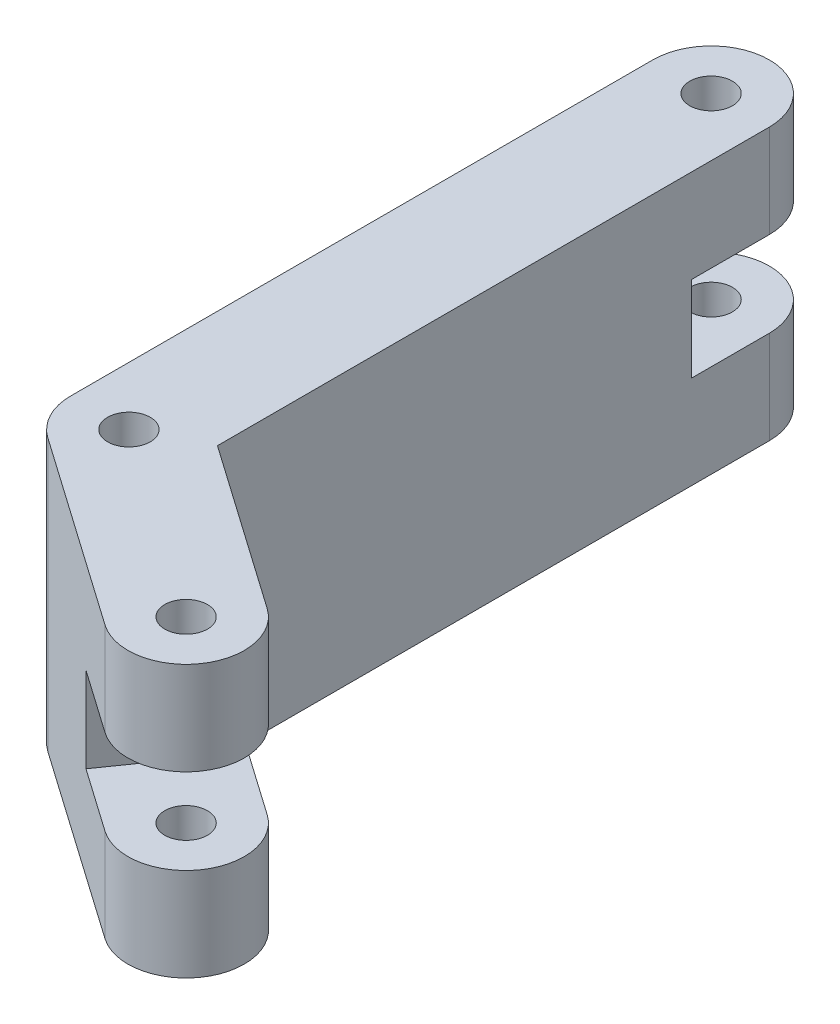
ISO-10303-21;
HEADER;
FILE_DESCRIPTION(('STEP AP214'),'2;1');
FILE_NAME('part.step','',(''),(''),'','','');
FILE_SCHEMA(('AUTOMOTIVE_DESIGN { 1 0 10303 214 1 1 1 1 }'));
ENDSEC;
DATA;
#1=APPLICATION_CONTEXT('core data for automotive mechanical design processes');
#2=APPLICATION_PROTOCOL_DEFINITION('international standard','automotive_design',2000,#1);
#3=PRODUCT_CONTEXT('',#1,'mechanical');
#4=PRODUCT('Part','Part','',(#3));
#5=PRODUCT_RELATED_PRODUCT_CATEGORY('part','',(#4));
#6=PRODUCT_DEFINITION_FORMATION('','',#4);
#7=PRODUCT_DEFINITION_CONTEXT('part definition',#1,'design');
#8=PRODUCT_DEFINITION('design','',#6,#7);
#9=PRODUCT_DEFINITION_SHAPE('','',#8);
#10=(LENGTH_UNIT() NAMED_UNIT(*) SI_UNIT(.MILLI.,.METRE.));
#11=(NAMED_UNIT(*) PLANE_ANGLE_UNIT() SI_UNIT($,.RADIAN.));
#12=(NAMED_UNIT(*) SI_UNIT($,.STERADIAN.) SOLID_ANGLE_UNIT());
#13=UNCERTAINTY_MEASURE_WITH_UNIT(LENGTH_MEASURE(1.E-05),#10,'distance_accuracy_value','');
#14=(GEOMETRIC_REPRESENTATION_CONTEXT(3) GLOBAL_UNCERTAINTY_ASSIGNED_CONTEXT((#13)) GLOBAL_UNIT_ASSIGNED_CONTEXT((#10,
#11,#12)) REPRESENTATION_CONTEXT('',''));
#15=CARTESIAN_POINT('',(0.,0.,0.));
#16=DIRECTION('',(0.,0.,1.));
#17=DIRECTION('',(1.,0.,0.));
#18=AXIS2_PLACEMENT_3D('',#15,#16,#17);
#19=CARTESIAN_POINT('',(-4.30182327263285,35.,6.14364033216744));
#20=DIRECTION('',(-0.573576436351047,0.,0.819152044288991));
#21=DIRECTION('',(0.819152044288991,0.,0.573576436351047));
#22=AXIS2_PLACEMENT_3D('',#19,#20,#21);
#23=PLANE('',#22);
#24=DIRECTION('',(0.,1.,0.));
#25=VECTOR('',#24,1.);
#26=CARTESIAN_POINT('',(12.081217613147,35.,17.6151690591884));
#27=LINE('',#26,#25);
#28=CARTESIAN_POINT('',(12.081217613147,12.,17.6151690591884));
#29=VERTEX_POINT('',#28);
#30=CARTESIAN_POINT('',(12.081217613147,23.,17.6151690591884));
#31=VERTEX_POINT('',#30);
#32=EDGE_CURVE('E149',#29,#31,#27,.T.);
#33=ORIENTED_EDGE('',*,*,#32,.T.);
#34=DIRECTION('',(0.819152044288991,0.,0.573576436351047));
#35=VECTOR('',#34,1.);
#36=CARTESIAN_POINT('',(-4.30182327263285,23.,6.14364033216744));
#37=LINE('',#36,#35);
#38=CARTESIAN_POINT('',(20.2727380560369,23.,23.3509334226988));
#39=VERTEX_POINT('',#38);
#40=EDGE_CURVE('E171',#31,#39,#37,.T.);
#41=ORIENTED_EDGE('',*,*,#40,.T.);
#42=DIRECTION('',(0.,-1.,0.));
#43=VECTOR('',#42,1.);
#44=CARTESIAN_POINT('',(20.2727380560369,35.,23.3509334226988));
#45=LINE('',#44,#43);
#46=CARTESIAN_POINT('',(20.2727380560369,35.,23.3509334226988));
#47=VERTEX_POINT('',#46);
#48=EDGE_CURVE('E268',#47,#39,#45,.T.);
#49=ORIENTED_EDGE('',*,*,#48,.F.);
#50=DIRECTION('',(-0.819152044288991,0.,-0.573576436351047));
#51=VECTOR('',#50,1.);
#52=CARTESIAN_POINT('',(-4.30182327263285,35.,6.14364033216744));
#53=LINE('',#52,#51);
#54=CARTESIAN_POINT('',(-4.30182327263285,35.,6.14364033216744));
#55=VERTEX_POINT('',#54);
#56=EDGE_CURVE('E200',#47,#55,#53,.T.);
#57=ORIENTED_EDGE('',*,*,#56,.T.);
#58=DIRECTION('',(0.,-1.,0.));
#59=VECTOR('',#58,1.);
#60=CARTESIAN_POINT('',(-4.30182327263285,35.,6.14364033216744));
#61=LINE('',#60,#59);
#62=CARTESIAN_POINT('',(-4.30182327263285,0.,6.14364033216744));
#63=VERTEX_POINT('',#62);
#64=EDGE_CURVE('E271',#55,#63,#61,.T.);
#65=ORIENTED_EDGE('',*,*,#64,.T.);
#66=DIRECTION('',(-0.819152044288991,0.,-0.573576436351047));
#67=VECTOR('',#66,1.);
#68=CARTESIAN_POINT('',(-4.30182327263285,0.,6.14364033216744));
#69=LINE('',#68,#67);
#70=CARTESIAN_POINT('',(20.2727380560369,0.,23.3509334226988));
#71=VERTEX_POINT('',#70);
#72=EDGE_CURVE('E227',#71,#63,#69,.T.);
#73=ORIENTED_EDGE('',*,*,#72,.F.);
#74=CARTESIAN_POINT('',(20.2727380560369,12.,23.3509334226988));
#75=VERTEX_POINT('',#74);
#76=EDGE_CURVE('E267',#75,#71,#45,.T.);
#77=ORIENTED_EDGE('',*,*,#76,.F.);
#78=DIRECTION('',(-0.819152044288991,0.,-0.573576436351047));
#79=VECTOR('',#78,1.);
#80=CARTESIAN_POINT('',(-4.30182327263285,12.,6.14364033216744));
#81=LINE('',#80,#79);
#82=EDGE_CURVE('E167',#75,#29,#81,.T.);
#83=ORIENTED_EDGE('',*,*,#82,.T.);
#84=EDGE_LOOP('',(#33,#41,#49,#57,#65,#73,#77,#83));
#85=FACE_BOUND('',#84,.T.);
#86=ADVANCED_FACE('F33',(#85),#23,.T.);
#87=CARTESIAN_POINT('',(24.5745613286697,35.,17.2072930905314));
#88=DIRECTION('',(0.,-1.,0.));
#89=DIRECTION('',(0.,0.,-1.));
#90=AXIS2_PLACEMENT_3D('',#87,#88,#89);
#91=CYLINDRICAL_SURFACE('',#90,7.5);
#92=CARTESIAN_POINT('',(24.5745613286697,23.,17.2072930905314));
#93=DIRECTION('',(0.,-1.,0.));
#94=DIRECTION('',(0.,0.,-1.));
#95=AXIS2_PLACEMENT_3D('',#92,#93,#94);
#96=CIRCLE('',#95,7.5);
#97=CARTESIAN_POINT('',(28.8763846013026,23.,11.063652758364));
#98=VERTEX_POINT('',#97);
#99=EDGE_CURVE('E169',#98,#39,#96,.T.);
#100=ORIENTED_EDGE('',*,*,#99,.F.);
#101=DIRECTION('',(0.,-1.,0.));
#102=VECTOR('',#101,1.);
#103=CARTESIAN_POINT('',(28.8763846013026,35.,11.063652758364));
#104=LINE('',#103,#102);
#105=CARTESIAN_POINT('',(28.8763846013026,35.,11.063652758364));
#106=VERTEX_POINT('',#105);
#107=EDGE_CURVE('E265',#106,#98,#104,.T.);
#108=ORIENTED_EDGE('',*,*,#107,.F.);
#109=CARTESIAN_POINT('',(24.5745613286697,35.,17.2072930905314));
#110=DIRECTION('',(0.,1.,0.));
#111=DIRECTION('',(0.,0.,1.));
#112=AXIS2_PLACEMENT_3D('',#109,#110,#111);
#113=CIRCLE('',#112,7.5);
#114=EDGE_CURVE('E204',#47,#106,#113,.T.);
#115=ORIENTED_EDGE('',*,*,#114,.F.);
#116=ORIENTED_EDGE('',*,*,#48,.T.);
#117=EDGE_LOOP('',(#100,#108,#115,#116));
#118=FACE_BOUND('',#117,.T.);
#119=ADVANCED_FACE('F289',(#118),#91,.T.);
#120=CARTESIAN_POINT('',(24.5745613286697,12.,17.2072930905314));
#121=DIRECTION('',(0.,1.,0.));
#122=DIRECTION('',(0.,0.,1.));
#123=AXIS2_PLACEMENT_3D('',#120,#121,#122);
#124=CIRCLE('',#123,7.5);
#125=CARTESIAN_POINT('',(28.8763846013026,12.,11.063652758364));
#126=VERTEX_POINT('',#125);
#127=EDGE_CURVE('E50',#75,#126,#124,.T.);
#128=ORIENTED_EDGE('',*,*,#127,.F.);
#129=ORIENTED_EDGE('',*,*,#76,.T.);
#130=CARTESIAN_POINT('',(24.5745613286697,0.,17.2072930905314));
#131=DIRECTION('',(0.,1.,0.));
#132=DIRECTION('',(0.,0.,1.));
#133=AXIS2_PLACEMENT_3D('',#130,#131,#132);
#134=CIRCLE('',#133,7.5);
#135=CARTESIAN_POINT('',(28.8763846013026,0.,11.063652758364));
#136=VERTEX_POINT('',#135);
#137=EDGE_CURVE('E230',#71,#136,#134,.T.);
#138=ORIENTED_EDGE('',*,*,#137,.T.);
#139=EDGE_CURVE('E264',#126,#136,#104,.T.);
#140=ORIENTED_EDGE('',*,*,#139,.F.);
#141=EDGE_LOOP('',(#128,#129,#138,#140));
#142=FACE_BOUND('',#141,.T.);
#143=ADVANCED_FACE('F294',(#142),#91,.T.);
#144=CARTESIAN_POINT('',(4.30182327263285,35.,-6.14364033216743));
#145=DIRECTION('',(-0.573576436351047,0.,0.819152044288991));
#146=DIRECTION('',(0.819152044288991,0.,0.573576436351047));
#147=AXIS2_PLACEMENT_3D('',#144,#145,#146);
#148=PLANE('',#147);
#149=DIRECTION('',(-0.819152044288991,0.,-0.573576436351047));
#150=VECTOR('',#149,1.);
#151=CARTESIAN_POINT('',(4.30182327263285,23.,-6.14364033216743));
#152=LINE('',#151,#150);
#153=CARTESIAN_POINT('',(20.6848641584127,23.,5.32788839485351));
#154=VERTEX_POINT('',#153);
#155=EDGE_CURVE('E157',#98,#154,#152,.T.);
#156=ORIENTED_EDGE('',*,*,#155,.T.);
#157=DIRECTION('',(0.,-1.,0.));
#158=VECTOR('',#157,1.);
#159=CARTESIAN_POINT('',(20.6848641584127,0.,5.32788839485351));
#160=LINE('',#159,#158);
#161=CARTESIAN_POINT('',(20.6848641584127,12.,5.32788839485351));
#162=VERTEX_POINT('',#161);
#163=EDGE_CURVE('E146',#154,#162,#160,.T.);
#164=ORIENTED_EDGE('',*,*,#163,.T.);
#165=DIRECTION('',(0.819152044288991,0.,0.573576436351047));
#166=VECTOR('',#165,1.);
#167=CARTESIAN_POINT('',(4.30182327263285,12.,-6.14364033216743));
#168=LINE('',#167,#166);
#169=EDGE_CURVE('E153',#162,#126,#168,.T.);
#170=ORIENTED_EDGE('',*,*,#169,.T.);
#171=ORIENTED_EDGE('',*,*,#139,.T.);
#172=DIRECTION('',(-0.819152044288991,0.,-0.573576436351047));
#173=VECTOR('',#172,1.);
#174=CARTESIAN_POINT('',(4.30182327263285,0.,-6.14364033216743));
#175=LINE('',#174,#173);
#176=CARTESIAN_POINT('',(7.50000000000001,0.,-3.90425287913808));
#177=VERTEX_POINT('',#176);
#178=EDGE_CURVE('E233',#136,#177,#175,.T.);
#179=ORIENTED_EDGE('',*,*,#178,.T.);
#180=DIRECTION('',(0.,-1.,0.));
#181=VECTOR('',#180,1.);
#182=CARTESIAN_POINT('',(7.50000000000001,35.,-3.90425287913808));
#183=LINE('',#182,#181);
#184=CARTESIAN_POINT('',(7.50000000000001,35.,-3.90425287913808));
#185=VERTEX_POINT('',#184);
#186=EDGE_CURVE('E262',#185,#177,#183,.T.);
#187=ORIENTED_EDGE('',*,*,#186,.F.);
#188=DIRECTION('',(-0.819152044288991,0.,-0.573576436351047));
#189=VECTOR('',#188,1.);
#190=CARTESIAN_POINT('',(4.30182327263285,35.,-6.14364033216743));
#191=LINE('',#190,#189);
#192=EDGE_CURVE('E206',#106,#185,#191,.T.);
#193=ORIENTED_EDGE('',*,*,#192,.F.);
#194=ORIENTED_EDGE('',*,*,#107,.T.);
#195=EDGE_LOOP('',(#156,#164,#170,#171,#179,#187,#193,#194));
#196=FACE_BOUND('',#195,.T.);
#197=ADVANCED_FACE('F159',(#196),#148,.F.);
#198=CARTESIAN_POINT('',(24.5745613286697,35.,17.2072930905314));
#199=DIRECTION('',(0.,-1.,0.));
#200=DIRECTION('',(0.,0.,-1.));
#201=AXIS2_PLACEMENT_3D('',#198,#199,#200);
#202=CYLINDRICAL_SURFACE('',#201,2.75);
#203=CARTESIAN_POINT('',(24.5745613286697,35.,17.2072930905314));
#204=DIRECTION('',(0.,1.,0.));
#205=DIRECTION('',(0.,0.,1.));
#206=AXIS2_PLACEMENT_3D('',#203,#204,#205);
#207=CIRCLE('',#206,2.75);
#208=CARTESIAN_POINT('',(24.5745613286697,35.,19.9572930905314));
#209=VERTEX_POINT('',#208);
#210=EDGE_CURVE('E221',#209,#209,#207,.T.);
#211=ORIENTED_EDGE('',*,*,#210,.T.);
#212=EDGE_LOOP('',(#211));
#213=FACE_BOUND('',#212,.T.);
#214=CARTESIAN_POINT('',(24.5745613286697,23.,17.2072930905314));
#215=DIRECTION('',(0.,-1.,0.));
#216=DIRECTION('',(0.,0.,-1.));
#217=AXIS2_PLACEMENT_3D('',#214,#215,#216);
#218=CIRCLE('',#217,2.75);
#219=CARTESIAN_POINT('',(24.5745613286697,23.,14.4572930905314));
#220=VERTEX_POINT('',#219);
#221=EDGE_CURVE('E37',#220,#220,#218,.T.);
#222=ORIENTED_EDGE('',*,*,#221,.T.);
#223=EDGE_LOOP('',(#222));
#224=FACE_BOUND('',#223,.T.);
#225=ADVANCED_FACE('F300',(#213,#224),#202,.F.);
#226=CARTESIAN_POINT('',(24.5745613286697,0.,17.2072930905314));
#227=DIRECTION('',(0.,1.,0.));
#228=DIRECTION('',(0.,0.,1.));
#229=AXIS2_PLACEMENT_3D('',#226,#227,#228);
#230=CIRCLE('',#229,2.75);
#231=CARTESIAN_POINT('',(24.5745613286697,0.,19.9572930905314));
#232=VERTEX_POINT('',#231);
#233=EDGE_CURVE('E201',#232,#232,#230,.T.);
#234=ORIENTED_EDGE('',*,*,#233,.F.);
#235=EDGE_LOOP('',(#234));
#236=FACE_BOUND('',#235,.T.);
#237=CARTESIAN_POINT('',(24.5745613286697,12.,17.2072930905314));
#238=DIRECTION('',(0.,1.,0.));
#239=DIRECTION('',(0.,0.,1.));
#240=AXIS2_PLACEMENT_3D('',#237,#238,#239);
#241=CIRCLE('',#240,2.75);
#242=CARTESIAN_POINT('',(24.5745613286697,12.,19.9572930905314));
#243=VERTEX_POINT('',#242);
#244=EDGE_CURVE('E164',#243,#243,#241,.T.);
#245=ORIENTED_EDGE('',*,*,#244,.T.);
#246=EDGE_LOOP('',(#245));
#247=FACE_BOUND('',#246,.T.);
#248=ADVANCED_FACE('F278',(#236,#247),#202,.F.);
#249=CARTESIAN_POINT('',(7.50000000000001,35.,0.));
#250=DIRECTION('',(1.,0.,0.));
#251=DIRECTION('',(0.,0.,-1.));
#252=AXIS2_PLACEMENT_3D('',#249,#250,#251);
#253=PLANE('',#252);
#254=DIRECTION('',(0.,-1.,0.));
#255=VECTOR('',#254,1.);
#256=CARTESIAN_POINT('',(7.5,35.,-75.));
#257=LINE('',#256,#255);
#258=CARTESIAN_POINT('',(7.5,12.,-75.));
#259=VERTEX_POINT('',#258);
#260=CARTESIAN_POINT('',(7.5,0.,-75.));
#261=VERTEX_POINT('',#260);
#262=EDGE_CURVE('E258',#259,#261,#257,.T.);
#263=ORIENTED_EDGE('',*,*,#262,.F.);
#264=DIRECTION('',(0.,0.,1.));
#265=VECTOR('',#264,1.);
#266=CARTESIAN_POINT('',(7.5,12.,-75.));
#267=LINE('',#266,#265);
#268=CARTESIAN_POINT('',(7.5,12.,-65.));
#269=VERTEX_POINT('',#268);
#270=EDGE_CURVE('E175',#259,#269,#267,.T.);
#271=ORIENTED_EDGE('',*,*,#270,.T.);
#272=DIRECTION('',(0.,1.,0.));
#273=VECTOR('',#272,1.);
#274=CARTESIAN_POINT('',(7.5,12.,-65.));
#275=LINE('',#274,#273);
#276=CARTESIAN_POINT('',(7.5,23.,-65.));
#277=VERTEX_POINT('',#276);
#278=EDGE_CURVE('E178',#269,#277,#275,.T.);
#279=ORIENTED_EDGE('',*,*,#278,.T.);
#280=DIRECTION('',(0.,0.,-1.));
#281=VECTOR('',#280,1.);
#282=CARTESIAN_POINT('',(7.5,23.,-65.));
#283=LINE('',#282,#281);
#284=CARTESIAN_POINT('',(7.5,23.,-75.));
#285=VERTEX_POINT('',#284);
#286=EDGE_CURVE('E181',#277,#285,#283,.T.);
#287=ORIENTED_EDGE('',*,*,#286,.T.);
#288=CARTESIAN_POINT('',(7.5,35.,-75.));
#289=VERTEX_POINT('',#288);
#290=EDGE_CURVE('E259',#289,#285,#257,.T.);
#291=ORIENTED_EDGE('',*,*,#290,.F.);
#292=DIRECTION('',(0.,0.,1.));
#293=VECTOR('',#292,1.);
#294=CARTESIAN_POINT('',(7.50000000000001,35.,0.));
#295=LINE('',#294,#293);
#296=EDGE_CURVE('E208',#289,#185,#295,.T.);
#297=ORIENTED_EDGE('',*,*,#296,.T.);
#298=ORIENTED_EDGE('',*,*,#186,.T.);
#299=DIRECTION('',(0.,0.,1.));
#300=VECTOR('',#299,1.);
#301=CARTESIAN_POINT('',(7.50000000000001,0.,0.));
#302=LINE('',#301,#300);
#303=EDGE_CURVE('E236',#261,#177,#302,.T.);
#304=ORIENTED_EDGE('',*,*,#303,.F.);
#305=EDGE_LOOP('',(#263,#271,#279,#287,#291,#297,#298,#304));
#306=FACE_BOUND('',#305,.T.);
#307=ADVANCED_FACE('F301',(#306),#253,.T.);
#308=CARTESIAN_POINT('',(0.,35.,-75.));
#309=DIRECTION('',(0.,-1.,0.));
#310=DIRECTION('',(0.,0.,-1.));
#311=AXIS2_PLACEMENT_3D('',#308,#309,#310);
#312=CYLINDRICAL_SURFACE('',#311,7.5);
#313=CARTESIAN_POINT('',(0.,12.,-75.));
#314=DIRECTION('',(0.,1.,0.));
#315=DIRECTION('',(0.,0.,1.));
#316=AXIS2_PLACEMENT_3D('',#313,#314,#315);
#317=CIRCLE('',#316,7.5);
#318=CARTESIAN_POINT('',(-7.5,12.,-75.));
#319=VERTEX_POINT('',#318);
#320=EDGE_CURVE('E192',#259,#319,#317,.T.);
#321=ORIENTED_EDGE('',*,*,#320,.F.);
#322=ORIENTED_EDGE('',*,*,#262,.T.);
#323=CARTESIAN_POINT('',(0.,0.,-75.));
#324=DIRECTION('',(0.,1.,0.));
#325=DIRECTION('',(0.,0.,1.));
#326=AXIS2_PLACEMENT_3D('',#323,#324,#325);
#327=CIRCLE('',#326,7.5);
#328=CARTESIAN_POINT('',(-7.5,0.,-75.));
#329=VERTEX_POINT('',#328);
#330=EDGE_CURVE('E239',#261,#329,#327,.T.);
#331=ORIENTED_EDGE('',*,*,#330,.T.);
#332=DIRECTION('',(0.,-1.,0.));
#333=VECTOR('',#332,1.);
#334=CARTESIAN_POINT('',(-7.5,35.,-75.));
#335=LINE('',#334,#333);
#336=EDGE_CURVE('E254',#319,#329,#335,.T.);
#337=ORIENTED_EDGE('',*,*,#336,.F.);
#338=EDGE_LOOP('',(#321,#322,#331,#337));
#339=FACE_BOUND('',#338,.T.);
#340=ADVANCED_FACE('F304',(#339),#312,.T.);
#341=CARTESIAN_POINT('',(0.,23.,-75.));
#342=DIRECTION('',(0.,-1.,0.));
#343=DIRECTION('',(0.,0.,-1.));
#344=AXIS2_PLACEMENT_3D('',#341,#342,#343);
#345=CIRCLE('',#344,7.5);
#346=CARTESIAN_POINT('',(-7.5,23.,-75.));
#347=VERTEX_POINT('',#346);
#348=EDGE_CURVE('E187',#347,#285,#345,.T.);
#349=ORIENTED_EDGE('',*,*,#348,.F.);
#350=CARTESIAN_POINT('',(-7.5,35.,-75.));
#351=VERTEX_POINT('',#350);
#352=EDGE_CURVE('E255',#351,#347,#335,.T.);
#353=ORIENTED_EDGE('',*,*,#352,.F.);
#354=CARTESIAN_POINT('',(0.,35.,-75.));
#355=DIRECTION('',(0.,1.,0.));
#356=DIRECTION('',(0.,0.,1.));
#357=AXIS2_PLACEMENT_3D('',#354,#355,#356);
#358=CIRCLE('',#357,7.5);
#359=EDGE_CURVE('E211',#289,#351,#358,.T.);
#360=ORIENTED_EDGE('',*,*,#359,.F.);
#361=ORIENTED_EDGE('',*,*,#290,.T.);
#362=EDGE_LOOP('',(#349,#353,#360,#361));
#363=FACE_BOUND('',#362,.T.);
#364=ADVANCED_FACE('F308',(#363),#312,.T.);
#365=CARTESIAN_POINT('',(0.,35.,-75.));
#366=DIRECTION('',(0.,-1.,0.));
#367=DIRECTION('',(0.,0.,-1.));
#368=AXIS2_PLACEMENT_3D('',#365,#366,#367);
#369=CYLINDRICAL_SURFACE('',#368,2.75);
#370=CARTESIAN_POINT('',(0.,0.,-75.));
#371=DIRECTION('',(0.,1.,0.));
#372=DIRECTION('',(0.,0.,1.));
#373=AXIS2_PLACEMENT_3D('',#370,#371,#372);
#374=CIRCLE('',#373,2.75);
#375=CARTESIAN_POINT('',(0.,0.,-72.25));
#376=VERTEX_POINT('',#375);
#377=EDGE_CURVE('E247',#376,#376,#374,.T.);
#378=ORIENTED_EDGE('',*,*,#377,.F.);
#379=EDGE_LOOP('',(#378));
#380=FACE_BOUND('',#379,.T.);
#381=CARTESIAN_POINT('',(0.,12.,-75.));
#382=DIRECTION('',(0.,1.,0.));
#383=DIRECTION('',(0.,0.,1.));
#384=AXIS2_PLACEMENT_3D('',#381,#382,#383);
#385=CIRCLE('',#384,2.75);
#386=CARTESIAN_POINT('',(0.,12.,-72.25));
#387=VERTEX_POINT('',#386);
#388=EDGE_CURVE('E194',#387,#387,#385,.T.);
#389=ORIENTED_EDGE('',*,*,#388,.T.);
#390=EDGE_LOOP('',(#389));
#391=FACE_BOUND('',#390,.T.);
#392=ADVANCED_FACE('F320',(#380,#391),#369,.F.);
#393=CARTESIAN_POINT('',(0.,35.,-75.));
#394=DIRECTION('',(0.,1.,0.));
#395=DIRECTION('',(0.,0.,1.));
#396=AXIS2_PLACEMENT_3D('',#393,#394,#395);
#397=CIRCLE('',#396,2.75);
#398=CARTESIAN_POINT('',(0.,35.,-72.25));
#399=VERTEX_POINT('',#398);
#400=EDGE_CURVE('E218',#399,#399,#397,.T.);
#401=ORIENTED_EDGE('',*,*,#400,.T.);
#402=EDGE_LOOP('',(#401));
#403=FACE_BOUND('',#402,.T.);
#404=CARTESIAN_POINT('',(0.,23.,-75.));
#405=DIRECTION('',(0.,-1.,0.));
#406=DIRECTION('',(0.,0.,-1.));
#407=AXIS2_PLACEMENT_3D('',#404,#405,#406);
#408=CIRCLE('',#407,2.75);
#409=CARTESIAN_POINT('',(0.,23.,-77.75));
#410=VERTEX_POINT('',#409);
#411=EDGE_CURVE('E189',#410,#410,#408,.T.);
#412=ORIENTED_EDGE('',*,*,#411,.T.);
#413=EDGE_LOOP('',(#412));
#414=FACE_BOUND('',#413,.T.);
#415=ADVANCED_FACE('F313',(#403,#414),#369,.F.);
#416=CARTESIAN_POINT('',(-7.49999999999999,35.,0.));
#417=DIRECTION('',(1.,0.,0.));
#418=DIRECTION('',(0.,0.,-1.));
#419=AXIS2_PLACEMENT_3D('',#416,#417,#418);
#420=PLANE('',#419);
#421=DIRECTION('',(0.,0.,1.));
#422=VECTOR('',#421,1.);
#423=CARTESIAN_POINT('',(-7.49999999999999,12.,0.));
#424=LINE('',#423,#422);
#425=CARTESIAN_POINT('',(-7.5,12.,-65.));
#426=VERTEX_POINT('',#425);
#427=EDGE_CURVE('E11',#319,#426,#424,.T.);
#428=ORIENTED_EDGE('',*,*,#427,.F.);
#429=ORIENTED_EDGE('',*,*,#336,.T.);
#430=DIRECTION('',(0.,0.,1.));
#431=VECTOR('',#430,1.);
#432=CARTESIAN_POINT('',(-7.49999999999999,0.,0.));
#433=LINE('',#432,#431);
#434=CARTESIAN_POINT('',(-7.5,0.,0.));
#435=VERTEX_POINT('',#434);
#436=EDGE_CURVE('E242',#329,#435,#433,.T.);
#437=ORIENTED_EDGE('',*,*,#436,.T.);
#438=DIRECTION('',(0.,-1.,0.));
#439=VECTOR('',#438,1.);
#440=CARTESIAN_POINT('',(-7.5,35.,0.));
#441=LINE('',#440,#439);
#442=CARTESIAN_POINT('',(-7.5,35.,0.));
#443=VERTEX_POINT('',#442);
#444=EDGE_CURVE('E224',#443,#435,#441,.T.);
#445=ORIENTED_EDGE('',*,*,#444,.F.);
#446=DIRECTION('',(0.,0.,1.));
#447=VECTOR('',#446,1.);
#448=CARTESIAN_POINT('',(-7.49999999999999,35.,0.));
#449=LINE('',#448,#447);
#450=EDGE_CURVE('E213',#351,#443,#449,.T.);
#451=ORIENTED_EDGE('',*,*,#450,.F.);
#452=ORIENTED_EDGE('',*,*,#352,.T.);
#453=DIRECTION('',(0.,0.,-1.));
#454=VECTOR('',#453,1.);
#455=CARTESIAN_POINT('',(-7.49999999999999,23.,0.));
#456=LINE('',#455,#454);
#457=CARTESIAN_POINT('',(-7.5,23.,-65.));
#458=VERTEX_POINT('',#457);
#459=EDGE_CURVE('E273',#458,#347,#456,.T.);
#460=ORIENTED_EDGE('',*,*,#459,.F.);
#461=DIRECTION('',(0.,1.,0.));
#462=VECTOR('',#461,1.);
#463=CARTESIAN_POINT('',(-7.5,35.,-65.));
#464=LINE('',#463,#462);
#465=EDGE_CURVE('E42',#426,#458,#464,.T.);
#466=ORIENTED_EDGE('',*,*,#465,.F.);
#467=EDGE_LOOP('',(#428,#429,#437,#445,#451,#452,#460,#466));
#468=FACE_BOUND('',#467,.T.);
#469=ADVANCED_FACE('F310',(#468),#420,.F.);
#470=CARTESIAN_POINT('',(0.,35.,0.));
#471=DIRECTION('',(0.,-1.,0.));
#472=DIRECTION('',(0.,0.,-1.));
#473=AXIS2_PLACEMENT_3D('',#470,#471,#472);
#474=CYLINDRICAL_SURFACE('',#473,7.5);
#475=CARTESIAN_POINT('',(0.,0.,0.));
#476=DIRECTION('',(0.,1.,0.));
#477=DIRECTION('',(0.,0.,1.));
#478=AXIS2_PLACEMENT_3D('',#475,#476,#477);
#479=CIRCLE('',#478,7.5);
#480=EDGE_CURVE('E197',#435,#63,#479,.T.);
#481=ORIENTED_EDGE('',*,*,#480,.T.);
#482=ORIENTED_EDGE('',*,*,#64,.F.);
#483=CARTESIAN_POINT('',(0.,35.,0.));
#484=DIRECTION('',(0.,1.,0.));
#485=DIRECTION('',(0.,0.,1.));
#486=AXIS2_PLACEMENT_3D('',#483,#484,#485);
#487=CIRCLE('',#486,7.5);
#488=EDGE_CURVE('E198',#443,#55,#487,.T.);
#489=ORIENTED_EDGE('',*,*,#488,.F.);
#490=ORIENTED_EDGE('',*,*,#444,.T.);
#491=EDGE_LOOP('',(#481,#482,#489,#490));
#492=FACE_BOUND('',#491,.T.);
#493=ADVANCED_FACE('F35',(#492),#474,.T.);
#494=CARTESIAN_POINT('',(0.,35.,0.));
#495=DIRECTION('',(0.,-1.,0.));
#496=DIRECTION('',(0.,0.,-1.));
#497=AXIS2_PLACEMENT_3D('',#494,#495,#496);
#498=CYLINDRICAL_SURFACE('',#497,2.75);
#499=CARTESIAN_POINT('',(0.,35.,0.));
#500=DIRECTION('',(0.,1.,0.));
#501=DIRECTION('',(0.,0.,1.));
#502=AXIS2_PLACEMENT_3D('',#499,#500,#501);
#503=CIRCLE('',#502,2.75);
#504=CARTESIAN_POINT('',(0.,35.,2.75));
#505=VERTEX_POINT('',#504);
#506=EDGE_CURVE('E215',#505,#505,#503,.T.);
#507=ORIENTED_EDGE('',*,*,#506,.T.);
#508=EDGE_LOOP('',(#507));
#509=FACE_BOUND('',#508,.T.);
#510=CARTESIAN_POINT('',(0.,0.,0.));
#511=DIRECTION('',(0.,1.,0.));
#512=DIRECTION('',(0.,0.,1.));
#513=AXIS2_PLACEMENT_3D('',#510,#511,#512);
#514=CIRCLE('',#513,2.75);
#515=CARTESIAN_POINT('',(0.,0.,2.75));
#516=VERTEX_POINT('',#515);
#517=EDGE_CURVE('E244',#516,#516,#514,.T.);
#518=ORIENTED_EDGE('',*,*,#517,.F.);
#519=EDGE_LOOP('',(#518));
#520=FACE_BOUND('',#519,.T.);
#521=ADVANCED_FACE('F315',(#509,#520),#498,.F.);
#522=CARTESIAN_POINT('',(0.,35.,0.));
#523=DIRECTION('',(0.,1.,0.));
#524=DIRECTION('',(0.,0.,1.));
#525=AXIS2_PLACEMENT_3D('',#522,#523,#524);
#526=PLANE('',#525);
#527=ORIENTED_EDGE('',*,*,#488,.T.);
#528=ORIENTED_EDGE('',*,*,#56,.F.);
#529=ORIENTED_EDGE('',*,*,#114,.T.);
#530=ORIENTED_EDGE('',*,*,#192,.T.);
#531=ORIENTED_EDGE('',*,*,#296,.F.);
#532=ORIENTED_EDGE('',*,*,#359,.T.);
#533=ORIENTED_EDGE('',*,*,#450,.T.);
#534=EDGE_LOOP('',(#527,#528,#529,#530,#531,#532,#533));
#535=FACE_BOUND('',#534,.T.);
#536=ORIENTED_EDGE('',*,*,#506,.F.);
#537=EDGE_LOOP('',(#536));
#538=FACE_BOUND('',#537,.T.);
#539=ORIENTED_EDGE('',*,*,#400,.F.);
#540=EDGE_LOOP('',(#539));
#541=FACE_BOUND('',#540,.T.);
#542=ORIENTED_EDGE('',*,*,#210,.F.);
#543=EDGE_LOOP('',(#542));
#544=FACE_BOUND('',#543,.T.);
#545=ADVANCED_FACE('F318',(#535,#538,#541,#544),#526,.T.);
#546=CARTESIAN_POINT('',(0.,0.,0.));
#547=DIRECTION('',(0.,1.,0.));
#548=DIRECTION('',(0.,0.,1.));
#549=AXIS2_PLACEMENT_3D('',#546,#547,#548);
#550=PLANE('',#549);
#551=ORIENTED_EDGE('',*,*,#480,.F.);
#552=ORIENTED_EDGE('',*,*,#436,.F.);
#553=ORIENTED_EDGE('',*,*,#330,.F.);
#554=ORIENTED_EDGE('',*,*,#303,.T.);
#555=ORIENTED_EDGE('',*,*,#178,.F.);
#556=ORIENTED_EDGE('',*,*,#137,.F.);
#557=ORIENTED_EDGE('',*,*,#72,.T.);
#558=EDGE_LOOP('',(#551,#552,#553,#554,#555,#556,#557));
#559=FACE_BOUND('',#558,.T.);
#560=ORIENTED_EDGE('',*,*,#517,.T.);
#561=EDGE_LOOP('',(#560));
#562=FACE_BOUND('',#561,.T.);
#563=ORIENTED_EDGE('',*,*,#377,.T.);
#564=EDGE_LOOP('',(#563));
#565=FACE_BOUND('',#564,.T.);
#566=ORIENTED_EDGE('',*,*,#233,.T.);
#567=EDGE_LOOP('',(#566));
#568=FACE_BOUND('',#567,.T.);
#569=ADVANCED_FACE('F327',(#559,#562,#565,#568),#550,.F.);
#570=CARTESIAN_POINT('',(-27.5,12.,-75.));
#571=DIRECTION('',(0.,1.,0.));
#572=DIRECTION('',(0.,0.,1.));
#573=AXIS2_PLACEMENT_3D('',#570,#571,#572);
#574=PLANE('',#573);
#575=ORIENTED_EDGE('',*,*,#388,.F.);
#576=EDGE_LOOP('',(#575));
#577=FACE_BOUND('',#576,.T.);
#578=ORIENTED_EDGE('',*,*,#320,.T.);
#579=ORIENTED_EDGE('',*,*,#427,.T.);
#580=DIRECTION('',(1.,0.,0.));
#581=VECTOR('',#580,1.);
#582=CARTESIAN_POINT('',(-27.5,12.,-65.));
#583=LINE('',#582,#581);
#584=EDGE_CURVE('E185',#426,#269,#583,.T.);
#585=ORIENTED_EDGE('',*,*,#584,.T.);
#586=ORIENTED_EDGE('',*,*,#270,.F.);
#587=EDGE_LOOP('',(#578,#579,#585,#586));
#588=FACE_BOUND('',#587,.T.);
#589=ADVANCED_FACE('F330',(#577,#588),#574,.T.);
#590=CARTESIAN_POINT('',(-27.5,12.,-65.));
#591=DIRECTION('',(0.,0.,-1.));
#592=DIRECTION('',(-1.,0.,0.));
#593=AXIS2_PLACEMENT_3D('',#590,#591,#592);
#594=PLANE('',#593);
#595=ORIENTED_EDGE('',*,*,#465,.T.);
#596=DIRECTION('',(1.,0.,0.));
#597=VECTOR('',#596,1.);
#598=CARTESIAN_POINT('',(-27.5,23.,-65.));
#599=LINE('',#598,#597);
#600=EDGE_CURVE('E58',#458,#277,#599,.T.);
#601=ORIENTED_EDGE('',*,*,#600,.T.);
#602=ORIENTED_EDGE('',*,*,#278,.F.);
#603=ORIENTED_EDGE('',*,*,#584,.F.);
#604=EDGE_LOOP('',(#595,#601,#602,#603));
#605=FACE_BOUND('',#604,.T.);
#606=ADVANCED_FACE('F337',(#605),#594,.T.);
#607=CARTESIAN_POINT('',(-27.5,23.,-65.));
#608=DIRECTION('',(0.,-1.,0.));
#609=DIRECTION('',(0.,0.,-1.));
#610=AXIS2_PLACEMENT_3D('',#607,#608,#609);
#611=PLANE('',#610);
#612=ORIENTED_EDGE('',*,*,#411,.F.);
#613=EDGE_LOOP('',(#612));
#614=FACE_BOUND('',#613,.T.);
#615=ORIENTED_EDGE('',*,*,#348,.T.);
#616=ORIENTED_EDGE('',*,*,#286,.F.);
#617=ORIENTED_EDGE('',*,*,#600,.F.);
#618=ORIENTED_EDGE('',*,*,#459,.T.);
#619=EDGE_LOOP('',(#615,#616,#617,#618));
#620=FACE_BOUND('',#619,.T.);
#621=ADVANCED_FACE('F341',(#614,#620),#611,.T.);
#622=CARTESIAN_POINT('',(-15.7733519996538,23.,22.5266812179473));
#623=DIRECTION('',(0.,-1.,0.));
#624=DIRECTION('',(0.,0.,-1.));
#625=AXIS2_PLACEMENT_3D('',#622,#623,#624);
#626=PLANE('',#625);
#627=ORIENTED_EDGE('',*,*,#221,.F.);
#628=EDGE_LOOP('',(#627));
#629=FACE_BOUND('',#628,.T.);
#630=DIRECTION('',(0.573576436351047,0.,-0.819152044288991));
#631=VECTOR('',#630,1.);
#632=CARTESIAN_POINT('',(0.60968888612602,23.,33.9982099449682));
#633=LINE('',#632,#631);
#634=EDGE_CURVE('E151',#31,#154,#633,.T.);
#635=ORIENTED_EDGE('',*,*,#634,.T.);
#636=ORIENTED_EDGE('',*,*,#155,.F.);
#637=ORIENTED_EDGE('',*,*,#99,.T.);
#638=ORIENTED_EDGE('',*,*,#40,.F.);
#639=EDGE_LOOP('',(#635,#636,#637,#638));
#640=FACE_BOUND('',#639,.T.);
#641=ADVANCED_FACE('F285',(#629,#640),#626,.T.);
#642=CARTESIAN_POINT('',(0.60968888612602,0.,33.9982099449682));
#643=DIRECTION('',(0.819152044288991,0.,0.573576436351047));
#644=DIRECTION('',(0.573576436351047,0.,-0.819152044288991));
#645=AXIS2_PLACEMENT_3D('',#642,#643,#644);
#646=PLANE('',#645);
#647=DIRECTION('',(0.573576436351047,0.,-0.819152044288991));
#648=VECTOR('',#647,1.);
#649=CARTESIAN_POINT('',(0.60968888612602,12.,33.9982099449682));
#650=LINE('',#649,#648);
#651=EDGE_CURVE('E142',#29,#162,#650,.T.);
#652=ORIENTED_EDGE('',*,*,#651,.T.);
#653=ORIENTED_EDGE('',*,*,#163,.F.);
#654=ORIENTED_EDGE('',*,*,#634,.F.);
#655=ORIENTED_EDGE('',*,*,#32,.F.);
#656=EDGE_LOOP('',(#652,#653,#654,#655));
#657=FACE_BOUND('',#656,.T.);
#658=ADVANCED_FACE('F143',(#657),#646,.T.);
#659=CARTESIAN_POINT('',(-15.7733519996538,12.,22.5266812179473));
#660=DIRECTION('',(0.,1.,0.));
#661=DIRECTION('',(0.,0.,1.));
#662=AXIS2_PLACEMENT_3D('',#659,#660,#661);
#663=PLANE('',#662);
#664=ORIENTED_EDGE('',*,*,#244,.F.);
#665=EDGE_LOOP('',(#664));
#666=FACE_BOUND('',#665,.T.);
#667=ORIENTED_EDGE('',*,*,#127,.T.);
#668=ORIENTED_EDGE('',*,*,#169,.F.);
#669=ORIENTED_EDGE('',*,*,#651,.F.);
#670=ORIENTED_EDGE('',*,*,#82,.F.);
#671=EDGE_LOOP('',(#667,#668,#669,#670));
#672=FACE_BOUND('',#671,.T.);
#673=ADVANCED_FACE('F154',(#666,#672),#663,.T.);
#674=CLOSED_SHELL('',(#86,#119,#143,#197,#225,#248,#307,#340,#364,#392,#415,#469,#493,#521,#545,
#569,#589,#606,#621,#641,#658,#673));
#675=MANIFOLD_SOLID_BREP('B2',#674);
#676=ADVANCED_BREP_SHAPE_REPRESENTATION('',(#18,#675),#14);
#677=SHAPE_DEFINITION_REPRESENTATION(#9,#676);
ENDSEC;
END-ISO-10303-21;
